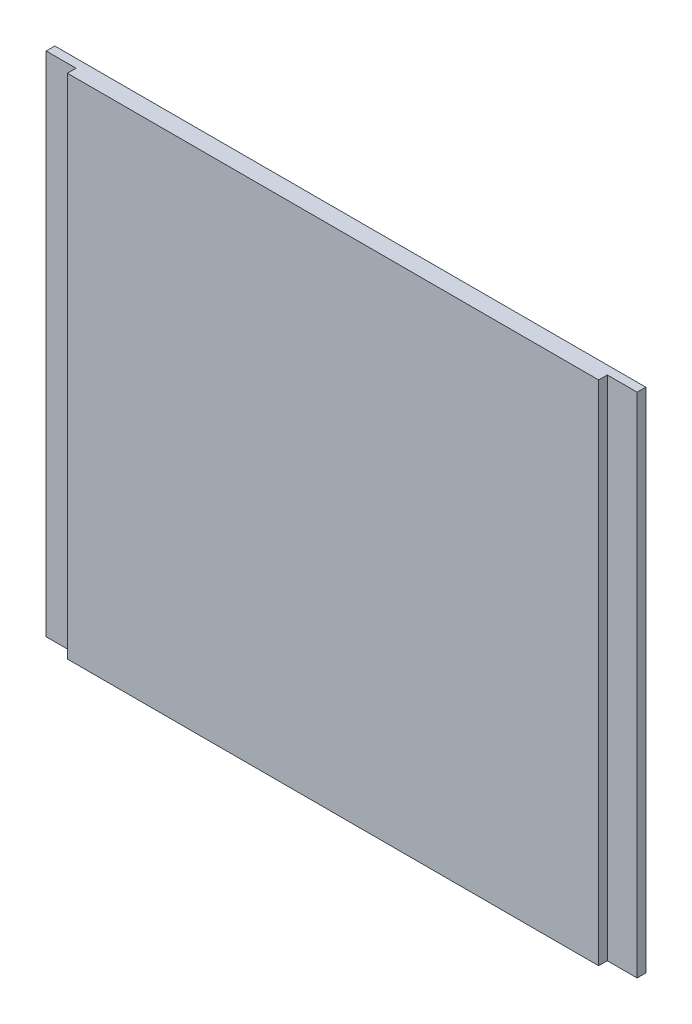
ISO-10303-21;
HEADER;
FILE_DESCRIPTION(('STEP AP214'),'2;1');
FILE_NAME('part.step','',(''),(''),'','','');
FILE_SCHEMA(('AUTOMOTIVE_DESIGN { 1 0 10303 214 1 1 1 1 }'));
ENDSEC;
DATA;
#1=APPLICATION_CONTEXT('core data for automotive mechanical design processes');
#2=APPLICATION_PROTOCOL_DEFINITION('international standard','automotive_design',2000,#1);
#3=PRODUCT_CONTEXT('',#1,'mechanical');
#4=PRODUCT('Part','Part','',(#3));
#5=PRODUCT_RELATED_PRODUCT_CATEGORY('part','',(#4));
#6=PRODUCT_DEFINITION_FORMATION('','',#4);
#7=PRODUCT_DEFINITION_CONTEXT('part definition',#1,'design');
#8=PRODUCT_DEFINITION('design','',#6,#7);
#9=PRODUCT_DEFINITION_SHAPE('','',#8);
#10=(LENGTH_UNIT() NAMED_UNIT(*) SI_UNIT(.MILLI.,.METRE.));
#11=(NAMED_UNIT(*) PLANE_ANGLE_UNIT() SI_UNIT($,.RADIAN.));
#12=(NAMED_UNIT(*) SI_UNIT($,.STERADIAN.) SOLID_ANGLE_UNIT());
#13=UNCERTAINTY_MEASURE_WITH_UNIT(LENGTH_MEASURE(1.E-05),#10,'distance_accuracy_value','');
#14=(GEOMETRIC_REPRESENTATION_CONTEXT(3) GLOBAL_UNCERTAINTY_ASSIGNED_CONTEXT((#13)) GLOBAL_UNIT_ASSIGNED_CONTEXT((#10,
#11,#12)) REPRESENTATION_CONTEXT('',''));
#15=CARTESIAN_POINT('',(0.,0.,0.));
#16=DIRECTION('',(0.,0.,1.));
#17=DIRECTION('',(1.,0.,0.));
#18=AXIS2_PLACEMENT_3D('',#15,#16,#17);
#19=CARTESIAN_POINT('',(-54.3137254901961,85.,0.));
#20=DIRECTION('',(1.,0.,0.));
#21=DIRECTION('',(0.,0.,-1.));
#22=AXIS2_PLACEMENT_3D('',#19,#20,#21);
#23=PLANE('',#22);
#24=DIRECTION('',(0.,0.,1.));
#25=VECTOR('',#24,1.);
#26=CARTESIAN_POINT('',(-54.3137254901961,0.,0.));
#27=LINE('',#26,#25);
#28=CARTESIAN_POINT('',(-54.3137254901961,0.,-1.45));
#29=VERTEX_POINT('',#28);
#30=CARTESIAN_POINT('',(-54.3137254901961,0.,0.));
#31=VERTEX_POINT('',#30);
#32=EDGE_CURVE('E130',#29,#31,#27,.T.);
#33=ORIENTED_EDGE('',*,*,#32,.T.);
#34=DIRECTION('',(0.,-1.,0.));
#35=VECTOR('',#34,1.);
#36=CARTESIAN_POINT('',(-54.3137254901961,85.,0.));
#37=LINE('',#36,#35);
#38=CARTESIAN_POINT('',(-54.3137254901961,85.,0.));
#39=VERTEX_POINT('',#38);
#40=EDGE_CURVE('E11',#39,#31,#37,.T.);
#41=ORIENTED_EDGE('',*,*,#40,.F.);
#42=DIRECTION('',(0.,0.,1.));
#43=VECTOR('',#42,1.);
#44=CARTESIAN_POINT('',(-54.3137254901961,85.,0.));
#45=LINE('',#44,#43);
#46=CARTESIAN_POINT('',(-54.3137254901961,85.,-1.45));
#47=VERTEX_POINT('',#46);
#48=EDGE_CURVE('E144',#47,#39,#45,.T.);
#49=ORIENTED_EDGE('',*,*,#48,.F.);
#50=DIRECTION('',(0.,-1.,0.));
#51=VECTOR('',#50,1.);
#52=CARTESIAN_POINT('',(-54.3137254901961,85.,-1.45));
#53=LINE('',#52,#51);
#54=EDGE_CURVE('E126',#47,#29,#53,.T.);
#55=ORIENTED_EDGE('',*,*,#54,.T.);
#56=EDGE_LOOP('',(#33,#41,#49,#55));
#57=FACE_BOUND('',#56,.T.);
#58=ADVANCED_FACE('F34',(#57),#23,.F.);
#59=CARTESIAN_POINT('',(-49.3137254901961,85.,0.));
#60=DIRECTION('',(0.,0.,-1.));
#61=DIRECTION('',(-1.,0.,0.));
#62=AXIS2_PLACEMENT_3D('',#59,#60,#61);
#63=PLANE('',#62);
#64=DIRECTION('',(1.,0.,0.));
#65=VECTOR('',#64,1.);
#66=CARTESIAN_POINT('',(-49.3137254901961,0.,0.));
#67=LINE('',#66,#65);
#68=CARTESIAN_POINT('',(-49.3137254901961,0.,0.));
#69=VERTEX_POINT('',#68);
#70=EDGE_CURVE('E133',#31,#69,#67,.T.);
#71=ORIENTED_EDGE('',*,*,#70,.T.);
#72=DIRECTION('',(0.,-1.,0.));
#73=VECTOR('',#72,1.);
#74=CARTESIAN_POINT('',(-49.3137254901961,85.,0.));
#75=LINE('',#74,#73);
#76=CARTESIAN_POINT('',(-49.3137254901961,85.,0.));
#77=VERTEX_POINT('',#76);
#78=EDGE_CURVE('E42',#77,#69,#75,.T.);
#79=ORIENTED_EDGE('',*,*,#78,.F.);
#80=DIRECTION('',(1.,0.,0.));
#81=VECTOR('',#80,1.);
#82=CARTESIAN_POINT('',(-49.3137254901961,85.,0.));
#83=LINE('',#82,#81);
#84=EDGE_CURVE('E93',#39,#77,#83,.T.);
#85=ORIENTED_EDGE('',*,*,#84,.F.);
#86=ORIENTED_EDGE('',*,*,#40,.T.);
#87=EDGE_LOOP('',(#71,#79,#85,#86));
#88=FACE_BOUND('',#87,.T.);
#89=ADVANCED_FACE('F179',(#88),#63,.F.);
#90=CARTESIAN_POINT('',(-49.3137254901961,85.,1.45));
#91=DIRECTION('',(1.,0.,0.));
#92=DIRECTION('',(0.,0.,-1.));
#93=AXIS2_PLACEMENT_3D('',#90,#91,#92);
#94=PLANE('',#93);
#95=DIRECTION('',(0.,0.,1.));
#96=VECTOR('',#95,1.);
#97=CARTESIAN_POINT('',(-49.3137254901961,0.,1.45));
#98=LINE('',#97,#96);
#99=CARTESIAN_POINT('',(-49.3137254901961,0.,1.45));
#100=VERTEX_POINT('',#99);
#101=EDGE_CURVE('E135',#69,#100,#98,.T.);
#102=ORIENTED_EDGE('',*,*,#101,.T.);
#103=DIRECTION('',(0.,-1.,0.));
#104=VECTOR('',#103,1.);
#105=CARTESIAN_POINT('',(-49.3137254901961,85.,1.45));
#106=LINE('',#105,#104);
#107=CARTESIAN_POINT('',(-49.3137254901961,85.,1.45));
#108=VERTEX_POINT('',#107);
#109=EDGE_CURVE('E151',#108,#100,#106,.T.);
#110=ORIENTED_EDGE('',*,*,#109,.F.);
#111=DIRECTION('',(0.,0.,1.));
#112=VECTOR('',#111,1.);
#113=CARTESIAN_POINT('',(-49.3137254901961,85.,1.45));
#114=LINE('',#113,#112);
#115=EDGE_CURVE('E159',#77,#108,#114,.T.);
#116=ORIENTED_EDGE('',*,*,#115,.F.);
#117=ORIENTED_EDGE('',*,*,#78,.T.);
#118=EDGE_LOOP('',(#102,#110,#116,#117));
#119=FACE_BOUND('',#118,.T.);
#120=ADVANCED_FACE('F157',(#119),#94,.F.);
#121=CARTESIAN_POINT('',(39.6862745098039,85.,1.44999999999999));
#122=DIRECTION('',(0.,0.,-1.));
#123=DIRECTION('',(-1.,0.,0.));
#124=AXIS2_PLACEMENT_3D('',#121,#122,#123);
#125=PLANE('',#124);
#126=DIRECTION('',(1.,0.,0.));
#127=VECTOR('',#126,1.);
#128=CARTESIAN_POINT('',(39.6862745098039,0.,1.44999999999999));
#129=LINE('',#128,#127);
#130=CARTESIAN_POINT('',(39.6862745098039,0.,1.44999999999999));
#131=VERTEX_POINT('',#130);
#132=EDGE_CURVE('E137',#100,#131,#129,.T.);
#133=ORIENTED_EDGE('',*,*,#132,.T.);
#134=DIRECTION('',(0.,-1.,0.));
#135=VECTOR('',#134,1.);
#136=CARTESIAN_POINT('',(39.6862745098039,85.,1.44999999999999));
#137=LINE('',#136,#135);
#138=CARTESIAN_POINT('',(39.6862745098039,85.,1.44999999999999));
#139=VERTEX_POINT('',#138);
#140=EDGE_CURVE('E148',#139,#131,#137,.T.);
#141=ORIENTED_EDGE('',*,*,#140,.F.);
#142=DIRECTION('',(1.,0.,0.));
#143=VECTOR('',#142,1.);
#144=CARTESIAN_POINT('',(39.6862745098039,85.,1.44999999999999));
#145=LINE('',#144,#143);
#146=EDGE_CURVE('E171',#108,#139,#145,.T.);
#147=ORIENTED_EDGE('',*,*,#146,.F.);
#148=ORIENTED_EDGE('',*,*,#109,.T.);
#149=EDGE_LOOP('',(#133,#141,#147,#148));
#150=FACE_BOUND('',#149,.T.);
#151=ADVANCED_FACE('F167',(#150),#125,.F.);
#152=CARTESIAN_POINT('',(39.6862745098039,85.,0.));
#153=DIRECTION('',(-1.,0.,0.));
#154=DIRECTION('',(0.,0.,1.));
#155=AXIS2_PLACEMENT_3D('',#152,#153,#154);
#156=PLANE('',#155);
#157=DIRECTION('',(0.,0.,-1.));
#158=VECTOR('',#157,1.);
#159=CARTESIAN_POINT('',(39.6862745098039,0.,0.));
#160=LINE('',#159,#158);
#161=CARTESIAN_POINT('',(39.6862745098039,0.,0.));
#162=VERTEX_POINT('',#161);
#163=EDGE_CURVE('E139',#131,#162,#160,.T.);
#164=ORIENTED_EDGE('',*,*,#163,.T.);
#165=DIRECTION('',(0.,-1.,0.));
#166=VECTOR('',#165,1.);
#167=CARTESIAN_POINT('',(39.6862745098039,85.,0.));
#168=LINE('',#167,#166);
#169=CARTESIAN_POINT('',(39.6862745098039,85.,0.));
#170=VERTEX_POINT('',#169);
#171=EDGE_CURVE('E121',#170,#162,#168,.T.);
#172=ORIENTED_EDGE('',*,*,#171,.F.);
#173=DIRECTION('',(0.,0.,-1.));
#174=VECTOR('',#173,1.);
#175=CARTESIAN_POINT('',(39.6862745098039,85.,0.));
#176=LINE('',#175,#174);
#177=EDGE_CURVE('E112',#139,#170,#176,.T.);
#178=ORIENTED_EDGE('',*,*,#177,.F.);
#179=ORIENTED_EDGE('',*,*,#140,.T.);
#180=EDGE_LOOP('',(#164,#172,#178,#179));
#181=FACE_BOUND('',#180,.T.);
#182=ADVANCED_FACE('F170',(#181),#156,.F.);
#183=CARTESIAN_POINT('',(44.6862745098039,85.,0.));
#184=DIRECTION('',(0.,0.,-1.));
#185=DIRECTION('',(-1.,0.,0.));
#186=AXIS2_PLACEMENT_3D('',#183,#184,#185);
#187=PLANE('',#186);
#188=DIRECTION('',(1.,0.,0.));
#189=VECTOR('',#188,1.);
#190=CARTESIAN_POINT('',(44.6862745098039,0.,0.));
#191=LINE('',#190,#189);
#192=CARTESIAN_POINT('',(44.6862745098039,0.,0.));
#193=VERTEX_POINT('',#192);
#194=EDGE_CURVE('E120',#162,#193,#191,.T.);
#195=ORIENTED_EDGE('',*,*,#194,.T.);
#196=DIRECTION('',(0.,-1.,0.));
#197=VECTOR('',#196,1.);
#198=CARTESIAN_POINT('',(44.6862745098039,85.,0.));
#199=LINE('',#198,#197);
#200=CARTESIAN_POINT('',(44.6862745098039,85.,0.));
#201=VERTEX_POINT('',#200);
#202=EDGE_CURVE('E117',#201,#193,#199,.T.);
#203=ORIENTED_EDGE('',*,*,#202,.F.);
#204=DIRECTION('',(1.,0.,0.));
#205=VECTOR('',#204,1.);
#206=CARTESIAN_POINT('',(44.6862745098039,85.,0.));
#207=LINE('',#206,#205);
#208=EDGE_CURVE('E106',#170,#201,#207,.T.);
#209=ORIENTED_EDGE('',*,*,#208,.F.);
#210=ORIENTED_EDGE('',*,*,#171,.T.);
#211=EDGE_LOOP('',(#195,#203,#209,#210));
#212=FACE_BOUND('',#211,.T.);
#213=ADVANCED_FACE('F118',(#212),#187,.F.);
#214=CARTESIAN_POINT('',(44.6862745098039,85.,-1.45));
#215=DIRECTION('',(-1.,0.,0.));
#216=DIRECTION('',(0.,0.,1.));
#217=AXIS2_PLACEMENT_3D('',#214,#215,#216);
#218=PLANE('',#217);
#219=DIRECTION('',(0.,0.,-1.));
#220=VECTOR('',#219,1.);
#221=CARTESIAN_POINT('',(44.6862745098039,0.,-1.45));
#222=LINE('',#221,#220);
#223=CARTESIAN_POINT('',(44.6862745098039,0.,-1.45));
#224=VERTEX_POINT('',#223);
#225=EDGE_CURVE('E79',#193,#224,#222,.T.);
#226=ORIENTED_EDGE('',*,*,#225,.T.);
#227=DIRECTION('',(0.,-1.,0.));
#228=VECTOR('',#227,1.);
#229=CARTESIAN_POINT('',(44.6862745098039,85.,-1.45));
#230=LINE('',#229,#228);
#231=CARTESIAN_POINT('',(44.6862745098039,85.,-1.45));
#232=VERTEX_POINT('',#231);
#233=EDGE_CURVE('E122',#232,#224,#230,.T.);
#234=ORIENTED_EDGE('',*,*,#233,.F.);
#235=DIRECTION('',(0.,0.,-1.));
#236=VECTOR('',#235,1.);
#237=CARTESIAN_POINT('',(44.6862745098039,85.,-1.45));
#238=LINE('',#237,#236);
#239=EDGE_CURVE('E110',#201,#232,#238,.T.);
#240=ORIENTED_EDGE('',*,*,#239,.F.);
#241=ORIENTED_EDGE('',*,*,#202,.T.);
#242=EDGE_LOOP('',(#226,#234,#240,#241));
#243=FACE_BOUND('',#242,.T.);
#244=ADVANCED_FACE('F124',(#243),#218,.F.);
#245=CARTESIAN_POINT('',(-54.3137254901961,85.,-1.45));
#246=DIRECTION('',(0.,0.,1.));
#247=DIRECTION('',(1.,0.,0.));
#248=AXIS2_PLACEMENT_3D('',#245,#246,#247);
#249=PLANE('',#248);
#250=DIRECTION('',(-1.,0.,0.));
#251=VECTOR('',#250,1.);
#252=CARTESIAN_POINT('',(-54.3137254901961,0.,-1.45));
#253=LINE('',#252,#251);
#254=EDGE_CURVE('E85',#224,#29,#253,.T.);
#255=ORIENTED_EDGE('',*,*,#254,.T.);
#256=ORIENTED_EDGE('',*,*,#54,.F.);
#257=DIRECTION('',(-1.,0.,0.));
#258=VECTOR('',#257,1.);
#259=CARTESIAN_POINT('',(-54.3137254901961,85.,-1.45));
#260=LINE('',#259,#258);
#261=EDGE_CURVE('E50',#232,#47,#260,.T.);
#262=ORIENTED_EDGE('',*,*,#261,.F.);
#263=ORIENTED_EDGE('',*,*,#233,.T.);
#264=EDGE_LOOP('',(#255,#256,#262,#263));
#265=FACE_BOUND('',#264,.T.);
#266=ADVANCED_FACE('F195',(#265),#249,.F.);
#267=CARTESIAN_POINT('',(0.,85.,0.));
#268=DIRECTION('',(0.,-1.,0.));
#269=DIRECTION('',(0.,0.,-1.));
#270=AXIS2_PLACEMENT_3D('',#267,#268,#269);
#271=PLANE('',#270);
#272=ORIENTED_EDGE('',*,*,#48,.T.);
#273=ORIENTED_EDGE('',*,*,#84,.T.);
#274=ORIENTED_EDGE('',*,*,#115,.T.);
#275=ORIENTED_EDGE('',*,*,#146,.T.);
#276=ORIENTED_EDGE('',*,*,#177,.T.);
#277=ORIENTED_EDGE('',*,*,#208,.T.);
#278=ORIENTED_EDGE('',*,*,#239,.T.);
#279=ORIENTED_EDGE('',*,*,#261,.T.);
#280=EDGE_LOOP('',(#272,#273,#274,#275,#276,#277,#278,#279));
#281=FACE_BOUND('',#280,.T.);
#282=ADVANCED_FACE('F108',(#281),#271,.F.);
#283=CARTESIAN_POINT('',(0.,0.,0.));
#284=DIRECTION('',(0.,-1.,0.));
#285=DIRECTION('',(0.,0.,-1.));
#286=AXIS2_PLACEMENT_3D('',#283,#284,#285);
#287=PLANE('',#286);
#288=ORIENTED_EDGE('',*,*,#32,.F.);
#289=ORIENTED_EDGE('',*,*,#254,.F.);
#290=ORIENTED_EDGE('',*,*,#225,.F.);
#291=ORIENTED_EDGE('',*,*,#194,.F.);
#292=ORIENTED_EDGE('',*,*,#163,.F.);
#293=ORIENTED_EDGE('',*,*,#132,.F.);
#294=ORIENTED_EDGE('',*,*,#101,.F.);
#295=ORIENTED_EDGE('',*,*,#70,.F.);
#296=EDGE_LOOP('',(#288,#289,#290,#291,#292,#293,#294,#295));
#297=FACE_BOUND('',#296,.T.);
#298=ADVANCED_FACE('F163',(#297),#287,.T.);
#299=CLOSED_SHELL('',(#58,#89,#120,#151,#182,#213,#244,#266,#282,#298));
#300=MANIFOLD_SOLID_BREP('B2',#299);
#301=ADVANCED_BREP_SHAPE_REPRESENTATION('',(#18,#300),#14);
#302=SHAPE_DEFINITION_REPRESENTATION(#9,#301);
ENDSEC;
END-ISO-10303-21;
